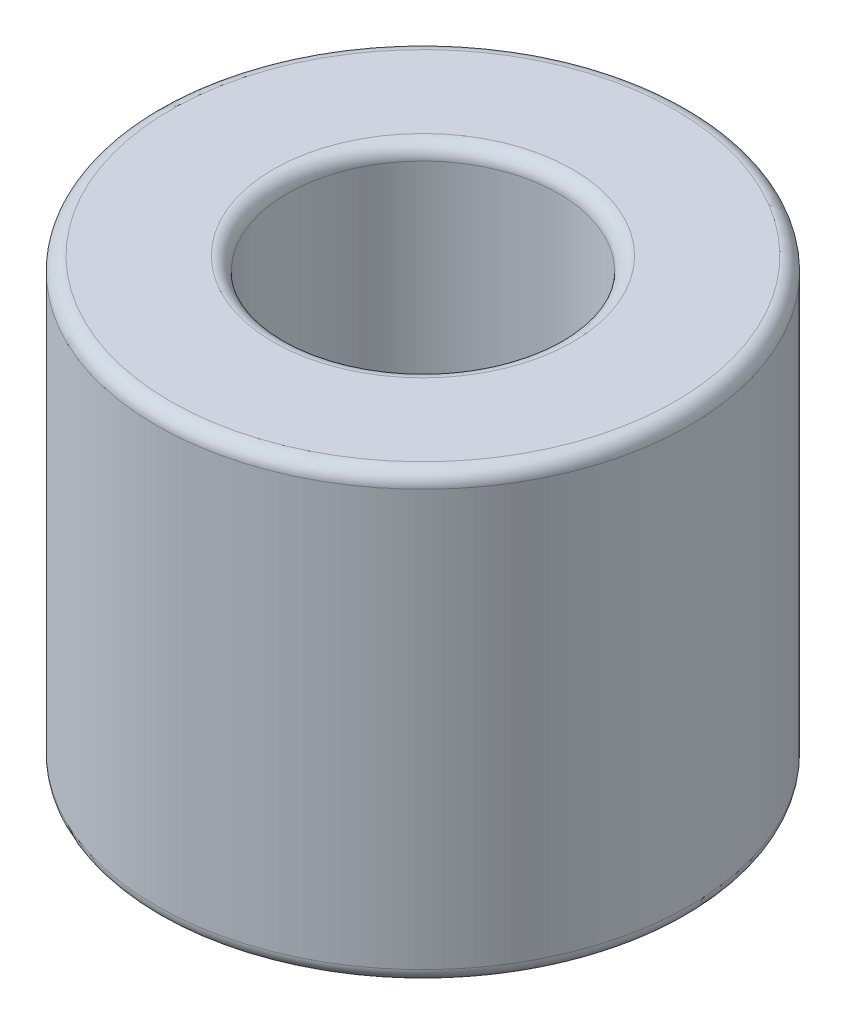
ISO-10303-21;
HEADER;
FILE_DESCRIPTION(('STEP AP214'),'2;1');
FILE_NAME('part.step','',(''),(''),'','','');
FILE_SCHEMA(('AUTOMOTIVE_DESIGN { 1 0 10303 214 1 1 1 1 }'));
ENDSEC;
DATA;
#1=APPLICATION_CONTEXT('core data for automotive mechanical design processes');
#2=APPLICATION_PROTOCOL_DEFINITION('international standard','automotive_design',2000,#1);
#3=PRODUCT_CONTEXT('',#1,'mechanical');
#4=PRODUCT('Part','Part','',(#3));
#5=PRODUCT_RELATED_PRODUCT_CATEGORY('part','',(#4));
#6=PRODUCT_DEFINITION_FORMATION('','',#4);
#7=PRODUCT_DEFINITION_CONTEXT('part definition',#1,'design');
#8=PRODUCT_DEFINITION('design','',#6,#7);
#9=PRODUCT_DEFINITION_SHAPE('','',#8);
#10=(LENGTH_UNIT() NAMED_UNIT(*) SI_UNIT(.MILLI.,.METRE.));
#11=(NAMED_UNIT(*) PLANE_ANGLE_UNIT() SI_UNIT($,.RADIAN.));
#12=(NAMED_UNIT(*) SI_UNIT($,.STERADIAN.) SOLID_ANGLE_UNIT());
#13=UNCERTAINTY_MEASURE_WITH_UNIT(LENGTH_MEASURE(1.E-05),#10,'distance_accuracy_value','');
#14=(GEOMETRIC_REPRESENTATION_CONTEXT(3) GLOBAL_UNCERTAINTY_ASSIGNED_CONTEXT((#13)) GLOBAL_UNIT_ASSIGNED_CONTEXT((#10,
#11,#12)) REPRESENTATION_CONTEXT('',''));
#15=CARTESIAN_POINT('',(0.,0.,0.));
#16=DIRECTION('',(0.,0.,1.));
#17=DIRECTION('',(1.,0.,0.));
#18=AXIS2_PLACEMENT_3D('',#15,#16,#17);
#19=CARTESIAN_POINT('',(0.,7.9375,0.));
#20=DIRECTION('',(0.,1.,0.));
#21=DIRECTION('',(0.,0.,1.));
#22=AXIS2_PLACEMENT_3D('',#19,#20,#21);
#23=PLANE('',#22);
#24=CARTESIAN_POINT('',(0.,7.9375,0.));
#25=DIRECTION('',(0.,1.,0.));
#26=DIRECTION('',(0.,0.,1.));
#27=AXIS2_PLACEMENT_3D('',#24,#25,#26);
#28=CIRCLE('',#27,5.3514);
#29=CARTESIAN_POINT('',(0.,7.9375,5.3514));
#30=VERTEX_POINT('',#29);
#31=EDGE_CURVE('E10',#30,#30,#28,.F.);
#32=ORIENTED_EDGE('',*,*,#31,.T.);
#33=EDGE_LOOP('',(#32));
#34=FACE_BOUND('',#33,.T.);
#35=CARTESIAN_POINT('',(0.,7.9375,0.));
#36=DIRECTION('',(0.,1.,0.));
#37=DIRECTION('',(0.,0.,1.));
#38=AXIS2_PLACEMENT_3D('',#35,#36,#37);
#39=CIRCLE('',#38,9.025);
#40=CARTESIAN_POINT('',(0.,7.9375,9.025));
#41=VERTEX_POINT('',#40);
#42=EDGE_CURVE('E37',#41,#41,#39,.T.);
#43=ORIENTED_EDGE('',*,*,#42,.T.);
#44=EDGE_LOOP('',(#43));
#45=FACE_BOUND('',#44,.T.);
#46=ADVANCED_FACE('F30',(#34,#45),#23,.T.);
#47=CARTESIAN_POINT('',(0.,-7.9375,0.));
#48=DIRECTION('',(0.,1.,0.));
#49=DIRECTION('',(0.,0.,1.));
#50=AXIS2_PLACEMENT_3D('',#47,#48,#49);
#51=PLANE('',#50);
#52=CARTESIAN_POINT('',(0.,-7.9375,0.));
#53=DIRECTION('',(0.,1.,0.));
#54=DIRECTION('',(0.,0.,1.));
#55=AXIS2_PLACEMENT_3D('',#52,#53,#54);
#56=CIRCLE('',#55,5.3514);
#57=CARTESIAN_POINT('',(0.,-7.9375,5.3514));
#58=VERTEX_POINT('',#57);
#59=EDGE_CURVE('E56',#58,#58,#56,.T.);
#60=ORIENTED_EDGE('',*,*,#59,.T.);
#61=EDGE_LOOP('',(#60));
#62=FACE_BOUND('',#61,.T.);
#63=CARTESIAN_POINT('',(0.,-7.9375,0.));
#64=DIRECTION('',(0.,1.,0.));
#65=DIRECTION('',(0.,0.,1.));
#66=AXIS2_PLACEMENT_3D('',#63,#64,#65);
#67=CIRCLE('',#66,9.025);
#68=CARTESIAN_POINT('',(0.,-7.9375,9.025));
#69=VERTEX_POINT('',#68);
#70=EDGE_CURVE('E59',#69,#69,#67,.F.);
#71=ORIENTED_EDGE('',*,*,#70,.T.);
#72=EDGE_LOOP('',(#71));
#73=FACE_BOUND('',#72,.T.);
#74=ADVANCED_FACE('F63',(#62,#73),#51,.F.);
#75=CARTESIAN_POINT('',(0.,7.9375,0.));
#76=DIRECTION('',(0.,-1.,0.));
#77=DIRECTION('',(0.,0.,-1.));
#78=AXIS2_PLACEMENT_3D('',#75,#76,#77);
#79=CYLINDRICAL_SURFACE('',#78,9.525);
#80=CARTESIAN_POINT('',(0.,-7.4375,0.));
#81=DIRECTION('',(0.,1.,0.));
#82=DIRECTION('',(0.,0.,1.));
#83=AXIS2_PLACEMENT_3D('',#80,#81,#82);
#84=CIRCLE('',#83,9.525);
#85=CARTESIAN_POINT('',(0.,-7.4375,9.525));
#86=VERTEX_POINT('',#85);
#87=EDGE_CURVE('E41',#86,#86,#84,.T.);
#88=ORIENTED_EDGE('',*,*,#87,.T.);
#89=EDGE_LOOP('',(#88));
#90=FACE_BOUND('',#89,.T.);
#91=CARTESIAN_POINT('',(0.,7.4375,0.));
#92=DIRECTION('',(0.,1.,0.));
#93=DIRECTION('',(0.,0.,1.));
#94=AXIS2_PLACEMENT_3D('',#91,#92,#93);
#95=CIRCLE('',#94,9.525);
#96=CARTESIAN_POINT('',(0.,7.4375,9.525));
#97=VERTEX_POINT('',#96);
#98=EDGE_CURVE('E45',#97,#97,#95,.F.);
#99=ORIENTED_EDGE('',*,*,#98,.T.);
#100=EDGE_LOOP('',(#99));
#101=FACE_BOUND('',#100,.T.);
#102=ADVANCED_FACE('F73',(#90,#101),#79,.T.);
#103=CARTESIAN_POINT('',(0.,7.9375,0.));
#104=DIRECTION('',(0.,-1.,0.));
#105=DIRECTION('',(0.,0.,-1.));
#106=AXIS2_PLACEMENT_3D('',#103,#104,#105);
#107=CYLINDRICAL_SURFACE('',#106,4.8514);
#108=CARTESIAN_POINT('',(0.,-7.4375,0.));
#109=DIRECTION('',(0.,1.,0.));
#110=DIRECTION('',(0.,0.,1.));
#111=AXIS2_PLACEMENT_3D('',#108,#109,#110);
#112=CIRCLE('',#111,4.8514);
#113=CARTESIAN_POINT('',(0.,-7.4375,4.8514));
#114=VERTEX_POINT('',#113);
#115=EDGE_CURVE('E50',#114,#114,#112,.F.);
#116=ORIENTED_EDGE('',*,*,#115,.T.);
#117=EDGE_LOOP('',(#116));
#118=FACE_BOUND('',#117,.T.);
#119=CARTESIAN_POINT('',(0.,7.4375,0.));
#120=DIRECTION('',(0.,1.,0.));
#121=DIRECTION('',(0.,0.,1.));
#122=AXIS2_PLACEMENT_3D('',#119,#120,#121);
#123=CIRCLE('',#122,4.8514);
#124=CARTESIAN_POINT('',(0.,7.4375,4.8514));
#125=VERTEX_POINT('',#124);
#126=EDGE_CURVE('E53',#125,#125,#123,.T.);
#127=ORIENTED_EDGE('',*,*,#126,.T.);
#128=EDGE_LOOP('',(#127));
#129=FACE_BOUND('',#128,.T.);
#130=ADVANCED_FACE('F76',(#118,#129),#107,.F.);
#131=CARTESIAN_POINT('',(0.,-7.4375,0.));
#132=DIRECTION('',(0.,1.,0.));
#133=DIRECTION('',(0.,0.,1.));
#134=AXIS2_PLACEMENT_3D('',#131,#132,#133);
#135=TOROIDAL_SURFACE('',#134,5.3514,0.5);
#136=ORIENTED_EDGE('',*,*,#115,.F.);
#137=EDGE_LOOP('',(#136));
#138=FACE_BOUND('',#137,.T.);
#139=ORIENTED_EDGE('',*,*,#59,.F.);
#140=EDGE_LOOP('',(#139));
#141=FACE_BOUND('',#140,.T.);
#142=ADVANCED_FACE('F69',(#138,#141),#135,.T.);
#143=CARTESIAN_POINT('',(0.,-7.4375,0.));
#144=DIRECTION('',(0.,1.,0.));
#145=DIRECTION('',(0.,0.,1.));
#146=AXIS2_PLACEMENT_3D('',#143,#144,#145);
#147=TOROIDAL_SURFACE('',#146,9.025,0.5);
#148=ORIENTED_EDGE('',*,*,#70,.F.);
#149=EDGE_LOOP('',(#148));
#150=FACE_BOUND('',#149,.T.);
#151=ORIENTED_EDGE('',*,*,#87,.F.);
#152=EDGE_LOOP('',(#151));
#153=FACE_BOUND('',#152,.T.);
#154=ADVANCED_FACE('F65',(#150,#153),#147,.T.);
#155=CARTESIAN_POINT('',(0.,7.4375,0.));
#156=DIRECTION('',(0.,1.,0.));
#157=DIRECTION('',(0.,0.,1.));
#158=AXIS2_PLACEMENT_3D('',#155,#156,#157);
#159=TOROIDAL_SURFACE('',#158,5.3514,0.5);
#160=ORIENTED_EDGE('',*,*,#31,.F.);
#161=EDGE_LOOP('',(#160));
#162=FACE_BOUND('',#161,.T.);
#163=ORIENTED_EDGE('',*,*,#126,.F.);
#164=EDGE_LOOP('',(#163));
#165=FACE_BOUND('',#164,.T.);
#166=ADVANCED_FACE('F68',(#162,#165),#159,.T.);
#167=CARTESIAN_POINT('',(0.,7.4375,0.));
#168=DIRECTION('',(0.,1.,0.));
#169=DIRECTION('',(0.,0.,1.));
#170=AXIS2_PLACEMENT_3D('',#167,#168,#169);
#171=TOROIDAL_SURFACE('',#170,9.025,0.5);
#172=ORIENTED_EDGE('',*,*,#98,.F.);
#173=EDGE_LOOP('',(#172));
#174=FACE_BOUND('',#173,.T.);
#175=ORIENTED_EDGE('',*,*,#42,.F.);
#176=EDGE_LOOP('',(#175));
#177=FACE_BOUND('',#176,.T.);
#178=ADVANCED_FACE('F32',(#174,#177),#171,.T.);
#179=CLOSED_SHELL('',(#46,#74,#102,#130,#142,#154,#166,#178));
#180=MANIFOLD_SOLID_BREP('B2',#179);
#181=ADVANCED_BREP_SHAPE_REPRESENTATION('',(#18,#180),#14);
#182=SHAPE_DEFINITION_REPRESENTATION(#9,#181);
ENDSEC;
END-ISO-10303-21;
